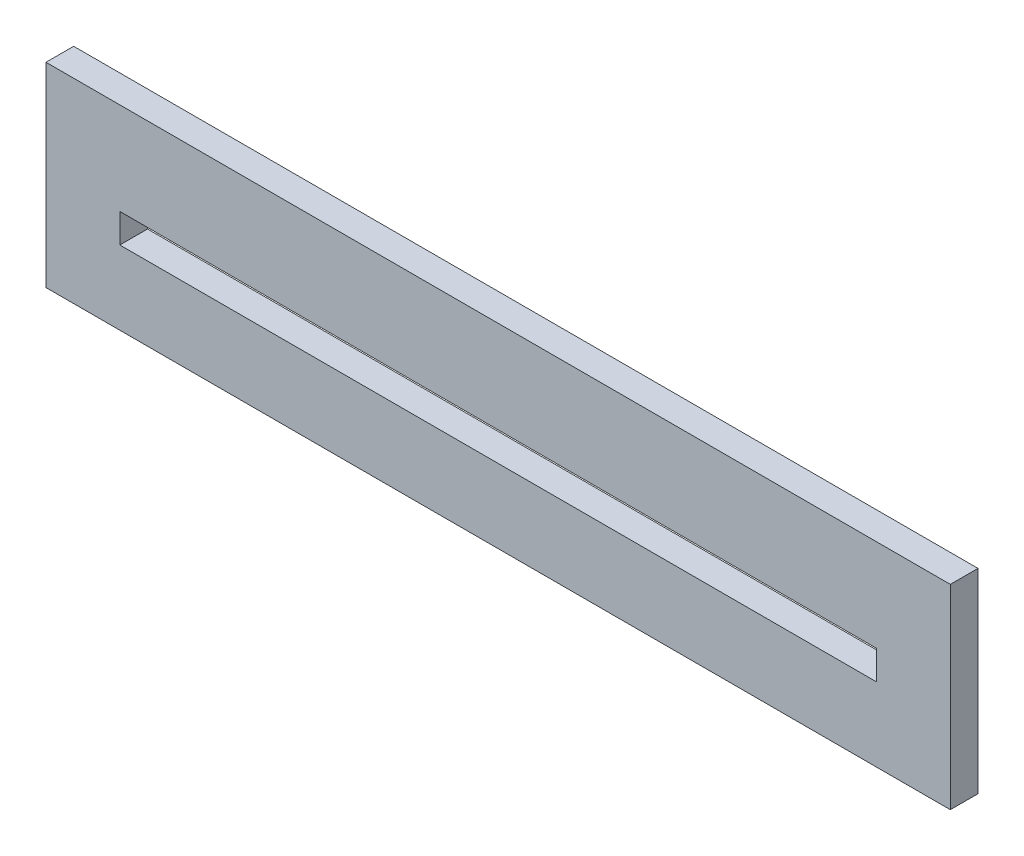
ISO-10303-21;
HEADER;
FILE_DESCRIPTION(('STEP AP214'),'2;1');
FILE_NAME('part.step','',(''),(''),'','','');
FILE_SCHEMA(('AUTOMOTIVE_DESIGN { 1 0 10303 214 1 1 1 1 }'));
ENDSEC;
DATA;
#1=APPLICATION_CONTEXT('core data for automotive mechanical design processes');
#2=APPLICATION_PROTOCOL_DEFINITION('international standard','automotive_design',2000,#1);
#3=PRODUCT_CONTEXT('',#1,'mechanical');
#4=PRODUCT('Part','Part','',(#3));
#5=PRODUCT_RELATED_PRODUCT_CATEGORY('part','',(#4));
#6=PRODUCT_DEFINITION_FORMATION('','',#4);
#7=PRODUCT_DEFINITION_CONTEXT('part definition',#1,'design');
#8=PRODUCT_DEFINITION('design','',#6,#7);
#9=PRODUCT_DEFINITION_SHAPE('','',#8);
#10=(LENGTH_UNIT() NAMED_UNIT(*) SI_UNIT(.MILLI.,.METRE.));
#11=(NAMED_UNIT(*) PLANE_ANGLE_UNIT() SI_UNIT($,.RADIAN.));
#12=(NAMED_UNIT(*) SI_UNIT($,.STERADIAN.) SOLID_ANGLE_UNIT());
#13=UNCERTAINTY_MEASURE_WITH_UNIT(LENGTH_MEASURE(1.E-05),#10,'distance_accuracy_value','');
#14=(GEOMETRIC_REPRESENTATION_CONTEXT(3) GLOBAL_UNCERTAINTY_ASSIGNED_CONTEXT((#13)) GLOBAL_UNIT_ASSIGNED_CONTEXT((#10,
#11,#12)) REPRESENTATION_CONTEXT('',''));
#15=CARTESIAN_POINT('',(0.,0.,0.));
#16=DIRECTION('',(0.,0.,1.));
#17=DIRECTION('',(1.,0.,0.));
#18=AXIS2_PLACEMENT_3D('',#15,#16,#17);
#19=CARTESIAN_POINT('',(-79.7568766642114,-1.575,3.));
#20=DIRECTION('',(0.,1.,0.));
#21=DIRECTION('',(1.,0.,0.));
#22=AXIS2_PLACEMENT_3D('',#19,#20,#21);
#23=PLANE('',#22);
#24=DIRECTION('',(1.,0.,0.));
#25=VECTOR('',#24,1.);
#26=CARTESIAN_POINT('',(-79.7568766642114,-1.575,0.));
#27=LINE('',#26,#25);
#28=CARTESIAN_POINT('',(-79.7568766642114,-1.575,0.));
#29=VERTEX_POINT('',#28);
#30=CARTESIAN_POINT('',(2.24312333578861,-1.575,0.));
#31=VERTEX_POINT('',#30);
#32=EDGE_CURVE('E106',#29,#31,#27,.T.);
#33=ORIENTED_EDGE('',*,*,#32,.F.);
#34=DIRECTION('',(0.,0.,-1.));
#35=VECTOR('',#34,1.);
#36=CARTESIAN_POINT('',(-79.7568766642114,-1.575,3.));
#37=LINE('',#36,#35);
#38=CARTESIAN_POINT('',(-79.7568766642114,-1.575,3.));
#39=VERTEX_POINT('',#38);
#40=EDGE_CURVE('E10',#39,#29,#37,.T.);
#41=ORIENTED_EDGE('',*,*,#40,.F.);
#42=DIRECTION('',(1.,0.,0.));
#43=VECTOR('',#42,1.);
#44=CARTESIAN_POINT('',(-79.7568766642114,-1.575,3.));
#45=LINE('',#44,#43);
#46=CARTESIAN_POINT('',(2.24312333578861,-1.575,3.));
#47=VERTEX_POINT('',#46);
#48=EDGE_CURVE('E109',#39,#47,#45,.T.);
#49=ORIENTED_EDGE('',*,*,#48,.T.);
#50=DIRECTION('',(0.,0.,-1.));
#51=VECTOR('',#50,1.);
#52=CARTESIAN_POINT('',(2.24312333578861,-1.575,3.));
#53=LINE('',#52,#51);
#54=EDGE_CURVE('E104',#47,#31,#53,.T.);
#55=ORIENTED_EDGE('',*,*,#54,.T.);
#56=EDGE_LOOP('',(#33,#41,#49,#55));
#57=FACE_BOUND('',#56,.T.);
#58=ADVANCED_FACE('F16',(#57),#23,.T.);
#59=CARTESIAN_POINT('',(-79.7568766642114,1.575,3.));
#60=DIRECTION('',(1.,0.,0.));
#61=DIRECTION('',(0.,1.,0.));
#62=AXIS2_PLACEMENT_3D('',#59,#60,#61);
#63=PLANE('',#62);
#64=DIRECTION('',(0.,-1.,0.));
#65=VECTOR('',#64,1.);
#66=CARTESIAN_POINT('',(-79.7568766642114,1.575,0.));
#67=LINE('',#66,#65);
#68=CARTESIAN_POINT('',(-79.7568766642114,1.575,0.));
#69=VERTEX_POINT('',#68);
#70=EDGE_CURVE('E124',#69,#29,#67,.T.);
#71=ORIENTED_EDGE('',*,*,#70,.F.);
#72=DIRECTION('',(0.,0.,-1.));
#73=VECTOR('',#72,1.);
#74=CARTESIAN_POINT('',(-79.7568766642114,1.575,3.));
#75=LINE('',#74,#73);
#76=CARTESIAN_POINT('',(-79.7568766642114,1.575,3.));
#77=VERTEX_POINT('',#76);
#78=EDGE_CURVE('E25',#77,#69,#75,.T.);
#79=ORIENTED_EDGE('',*,*,#78,.F.);
#80=DIRECTION('',(0.,-1.,0.));
#81=VECTOR('',#80,1.);
#82=CARTESIAN_POINT('',(-79.7568766642114,1.575,3.));
#83=LINE('',#82,#81);
#84=EDGE_CURVE('E164',#77,#39,#83,.T.);
#85=ORIENTED_EDGE('',*,*,#84,.T.);
#86=ORIENTED_EDGE('',*,*,#40,.T.);
#87=EDGE_LOOP('',(#71,#79,#85,#86));
#88=FACE_BOUND('',#87,.T.);
#89=ADVANCED_FACE('F206',(#88),#63,.T.);
#90=CARTESIAN_POINT('',(-79.7568766642114,1.575,3.));
#91=DIRECTION('',(0.,-1.,0.));
#92=DIRECTION('',(0.,0.,-1.));
#93=AXIS2_PLACEMENT_3D('',#90,#91,#92);
#94=PLANE('',#93);
#95=DIRECTION('',(-1.,0.,0.));
#96=VECTOR('',#95,1.);
#97=CARTESIAN_POINT('',(-79.7568766642114,1.575,0.));
#98=LINE('',#97,#96);
#99=CARTESIAN_POINT('',(2.24312333578861,1.575,0.));
#100=VERTEX_POINT('',#99);
#101=EDGE_CURVE('E130',#100,#69,#98,.T.);
#102=ORIENTED_EDGE('',*,*,#101,.F.);
#103=DIRECTION('',(0.,0.,-1.));
#104=VECTOR('',#103,1.);
#105=CARTESIAN_POINT('',(2.24312333578861,1.575,3.));
#106=LINE('',#105,#104);
#107=CARTESIAN_POINT('',(2.24312333578861,1.575,3.));
#108=VERTEX_POINT('',#107);
#109=EDGE_CURVE('E115',#108,#100,#106,.T.);
#110=ORIENTED_EDGE('',*,*,#109,.F.);
#111=DIRECTION('',(-1.,0.,0.));
#112=VECTOR('',#111,1.);
#113=CARTESIAN_POINT('',(-79.7568766642114,1.575,3.));
#114=LINE('',#113,#112);
#115=EDGE_CURVE('E171',#108,#77,#114,.T.);
#116=ORIENTED_EDGE('',*,*,#115,.T.);
#117=ORIENTED_EDGE('',*,*,#78,.T.);
#118=EDGE_LOOP('',(#102,#110,#116,#117));
#119=FACE_BOUND('',#118,.T.);
#120=ADVANCED_FACE('F18',(#119),#94,.T.);
#121=CARTESIAN_POINT('',(2.24312333578861,1.575,3.));
#122=DIRECTION('',(-1.,0.,0.));
#123=DIRECTION('',(0.,1.,0.));
#124=AXIS2_PLACEMENT_3D('',#121,#122,#123);
#125=PLANE('',#124);
#126=DIRECTION('',(0.,1.,0.));
#127=VECTOR('',#126,1.);
#128=CARTESIAN_POINT('',(2.24312333578861,1.575,0.));
#129=LINE('',#128,#127);
#130=EDGE_CURVE('E123',#31,#100,#129,.T.);
#131=ORIENTED_EDGE('',*,*,#130,.F.);
#132=ORIENTED_EDGE('',*,*,#54,.F.);
#133=DIRECTION('',(0.,1.,0.));
#134=VECTOR('',#133,1.);
#135=CARTESIAN_POINT('',(2.24312333578861,1.575,3.));
#136=LINE('',#135,#134);
#137=EDGE_CURVE('E170',#47,#108,#136,.T.);
#138=ORIENTED_EDGE('',*,*,#137,.T.);
#139=ORIENTED_EDGE('',*,*,#109,.T.);
#140=EDGE_LOOP('',(#131,#132,#138,#139));
#141=FACE_BOUND('',#140,.T.);
#142=ADVANCED_FACE('F128',(#141),#125,.T.);
#143=CARTESIAN_POINT('',(-87.7568766642114,-9.575,3.));
#144=DIRECTION('',(0.,1.,0.));
#145=DIRECTION('',(1.,0.,0.));
#146=AXIS2_PLACEMENT_3D('',#143,#144,#145);
#147=PLANE('',#146);
#148=DIRECTION('',(1.,0.,0.));
#149=VECTOR('',#148,1.);
#150=CARTESIAN_POINT('',(-87.7568766642114,-9.575,0.));
#151=LINE('',#150,#149);
#152=CARTESIAN_POINT('',(-87.7568766642114,-9.575,0.));
#153=VERTEX_POINT('',#152);
#154=CARTESIAN_POINT('',(10.2431233357886,-9.575,0.));
#155=VERTEX_POINT('',#154);
#156=EDGE_CURVE('E158',#153,#155,#151,.T.);
#157=ORIENTED_EDGE('',*,*,#156,.T.);
#158=DIRECTION('',(0.,0.,-1.));
#159=VECTOR('',#158,1.);
#160=CARTESIAN_POINT('',(10.2431233357886,-9.575,3.));
#161=LINE('',#160,#159);
#162=CARTESIAN_POINT('',(10.2431233357886,-9.575,3.));
#163=VERTEX_POINT('',#162);
#164=EDGE_CURVE('E145',#163,#155,#161,.T.);
#165=ORIENTED_EDGE('',*,*,#164,.F.);
#166=DIRECTION('',(1.,0.,0.));
#167=VECTOR('',#166,1.);
#168=CARTESIAN_POINT('',(-87.7568766642114,-9.575,3.));
#169=LINE('',#168,#167);
#170=CARTESIAN_POINT('',(-87.7568766642114,-9.575,3.));
#171=VERTEX_POINT('',#170);
#172=EDGE_CURVE('E174',#171,#163,#169,.T.);
#173=ORIENTED_EDGE('',*,*,#172,.F.);
#174=DIRECTION('',(0.,0.,-1.));
#175=VECTOR('',#174,1.);
#176=CARTESIAN_POINT('',(-87.7568766642114,-9.575,3.));
#177=LINE('',#176,#175);
#178=EDGE_CURVE('E116',#171,#153,#177,.T.);
#179=ORIENTED_EDGE('',*,*,#178,.T.);
#180=EDGE_LOOP('',(#157,#165,#173,#179));
#181=FACE_BOUND('',#180,.T.);
#182=ADVANCED_FACE('F212',(#181),#147,.F.);
#183=CARTESIAN_POINT('',(-87.7568766642114,11.575,3.));
#184=DIRECTION('',(1.,0.,0.));
#185=DIRECTION('',(0.,1.,0.));
#186=AXIS2_PLACEMENT_3D('',#183,#184,#185);
#187=PLANE('',#186);
#188=DIRECTION('',(0.,-1.,0.));
#189=VECTOR('',#188,1.);
#190=CARTESIAN_POINT('',(-87.7568766642114,11.575,0.));
#191=LINE('',#190,#189);
#192=CARTESIAN_POINT('',(-87.7568766642114,11.575,0.));
#193=VERTEX_POINT('',#192);
#194=EDGE_CURVE('E139',#193,#153,#191,.T.);
#195=ORIENTED_EDGE('',*,*,#194,.T.);
#196=ORIENTED_EDGE('',*,*,#178,.F.);
#197=DIRECTION('',(0.,-1.,0.));
#198=VECTOR('',#197,1.);
#199=CARTESIAN_POINT('',(-87.7568766642114,11.575,3.));
#200=LINE('',#199,#198);
#201=CARTESIAN_POINT('',(-87.7568766642114,11.575,3.));
#202=VERTEX_POINT('',#201);
#203=EDGE_CURVE('E178',#202,#171,#200,.T.);
#204=ORIENTED_EDGE('',*,*,#203,.F.);
#205=DIRECTION('',(0.,0.,-1.));
#206=VECTOR('',#205,1.);
#207=CARTESIAN_POINT('',(-87.7568766642114,11.575,3.));
#208=LINE('',#207,#206);
#209=EDGE_CURVE('E146',#202,#193,#208,.T.);
#210=ORIENTED_EDGE('',*,*,#209,.T.);
#211=EDGE_LOOP('',(#195,#196,#204,#210));
#212=FACE_BOUND('',#211,.T.);
#213=ADVANCED_FACE('F219',(#212),#187,.F.);
#214=CARTESIAN_POINT('',(-87.7568766642114,11.575,3.));
#215=DIRECTION('',(0.,-1.,0.));
#216=DIRECTION('',(0.,0.,-1.));
#217=AXIS2_PLACEMENT_3D('',#214,#215,#216);
#218=PLANE('',#217);
#219=DIRECTION('',(-1.,0.,0.));
#220=VECTOR('',#219,1.);
#221=CARTESIAN_POINT('',(-87.7568766642114,11.575,0.));
#222=LINE('',#221,#220);
#223=CARTESIAN_POINT('',(10.2431233357886,11.575,0.));
#224=VERTEX_POINT('',#223);
#225=EDGE_CURVE('E131',#224,#193,#222,.T.);
#226=ORIENTED_EDGE('',*,*,#225,.T.);
#227=ORIENTED_EDGE('',*,*,#209,.F.);
#228=DIRECTION('',(-1.,0.,0.));
#229=VECTOR('',#228,1.);
#230=CARTESIAN_POINT('',(-87.7568766642114,11.575,3.));
#231=LINE('',#230,#229);
#232=CARTESIAN_POINT('',(10.2431233357886,11.575,3.));
#233=VERTEX_POINT('',#232);
#234=EDGE_CURVE('E182',#233,#202,#231,.T.);
#235=ORIENTED_EDGE('',*,*,#234,.F.);
#236=DIRECTION('',(0.,0.,-1.));
#237=VECTOR('',#236,1.);
#238=CARTESIAN_POINT('',(10.2431233357886,11.575,3.));
#239=LINE('',#238,#237);
#240=EDGE_CURVE('E126',#233,#224,#239,.T.);
#241=ORIENTED_EDGE('',*,*,#240,.T.);
#242=EDGE_LOOP('',(#226,#227,#235,#241));
#243=FACE_BOUND('',#242,.T.);
#244=ADVANCED_FACE('F222',(#243),#218,.F.);
#245=CARTESIAN_POINT('',(10.2431233357886,11.575,3.));
#246=DIRECTION('',(-1.,0.,0.));
#247=DIRECTION('',(0.,0.,1.));
#248=AXIS2_PLACEMENT_3D('',#245,#246,#247);
#249=PLANE('',#248);
#250=DIRECTION('',(0.,1.,0.));
#251=VECTOR('',#250,1.);
#252=CARTESIAN_POINT('',(10.2431233357886,11.575,0.));
#253=LINE('',#252,#251);
#254=EDGE_CURVE('E161',#155,#224,#253,.T.);
#255=ORIENTED_EDGE('',*,*,#254,.T.);
#256=ORIENTED_EDGE('',*,*,#240,.F.);
#257=DIRECTION('',(0.,1.,0.));
#258=VECTOR('',#257,1.);
#259=CARTESIAN_POINT('',(10.2431233357886,11.575,3.));
#260=LINE('',#259,#258);
#261=EDGE_CURVE('E189',#163,#233,#260,.T.);
#262=ORIENTED_EDGE('',*,*,#261,.F.);
#263=ORIENTED_EDGE('',*,*,#164,.T.);
#264=EDGE_LOOP('',(#255,#256,#262,#263));
#265=FACE_BOUND('',#264,.T.);
#266=ADVANCED_FACE('F226',(#265),#249,.F.);
#267=CARTESIAN_POINT('',(0.,0.,0.));
#268=DIRECTION('',(0.,0.,1.));
#269=DIRECTION('',(1.,0.,0.));
#270=AXIS2_PLACEMENT_3D('',#267,#268,#269);
#271=PLANE('',#270);
#272=ORIENTED_EDGE('',*,*,#130,.T.);
#273=ORIENTED_EDGE('',*,*,#101,.T.);
#274=ORIENTED_EDGE('',*,*,#70,.T.);
#275=ORIENTED_EDGE('',*,*,#32,.T.);
#276=EDGE_LOOP('',(#272,#273,#274,#275));
#277=FACE_BOUND('',#276,.T.);
#278=ORIENTED_EDGE('',*,*,#254,.F.);
#279=ORIENTED_EDGE('',*,*,#156,.F.);
#280=ORIENTED_EDGE('',*,*,#194,.F.);
#281=ORIENTED_EDGE('',*,*,#225,.F.);
#282=EDGE_LOOP('',(#278,#279,#280,#281));
#283=FACE_BOUND('',#282,.T.);
#284=ADVANCED_FACE('F120',(#277,#283),#271,.F.);
#285=CARTESIAN_POINT('',(0.,0.,3.));
#286=DIRECTION('',(0.,0.,1.));
#287=DIRECTION('',(1.,0.,0.));
#288=AXIS2_PLACEMENT_3D('',#285,#286,#287);
#289=PLANE('',#288);
#290=ORIENTED_EDGE('',*,*,#115,.F.);
#291=ORIENTED_EDGE('',*,*,#137,.F.);
#292=ORIENTED_EDGE('',*,*,#48,.F.);
#293=ORIENTED_EDGE('',*,*,#84,.F.);
#294=EDGE_LOOP('',(#290,#291,#292,#293));
#295=FACE_BOUND('',#294,.T.);
#296=ORIENTED_EDGE('',*,*,#261,.T.);
#297=ORIENTED_EDGE('',*,*,#234,.T.);
#298=ORIENTED_EDGE('',*,*,#203,.T.);
#299=ORIENTED_EDGE('',*,*,#172,.T.);
#300=EDGE_LOOP('',(#296,#297,#298,#299));
#301=FACE_BOUND('',#300,.T.);
#302=ADVANCED_FACE('F203',(#295,#301),#289,.T.);
#303=CLOSED_SHELL('',(#58,#89,#120,#142,#182,#213,#244,#266,#284,#302));
#304=MANIFOLD_SOLID_BREP('B1',#303);
#305=ADVANCED_BREP_SHAPE_REPRESENTATION('',(#18,#304),#14);
#306=SHAPE_DEFINITION_REPRESENTATION(#9,#305);
ENDSEC;
END-ISO-10303-21;
